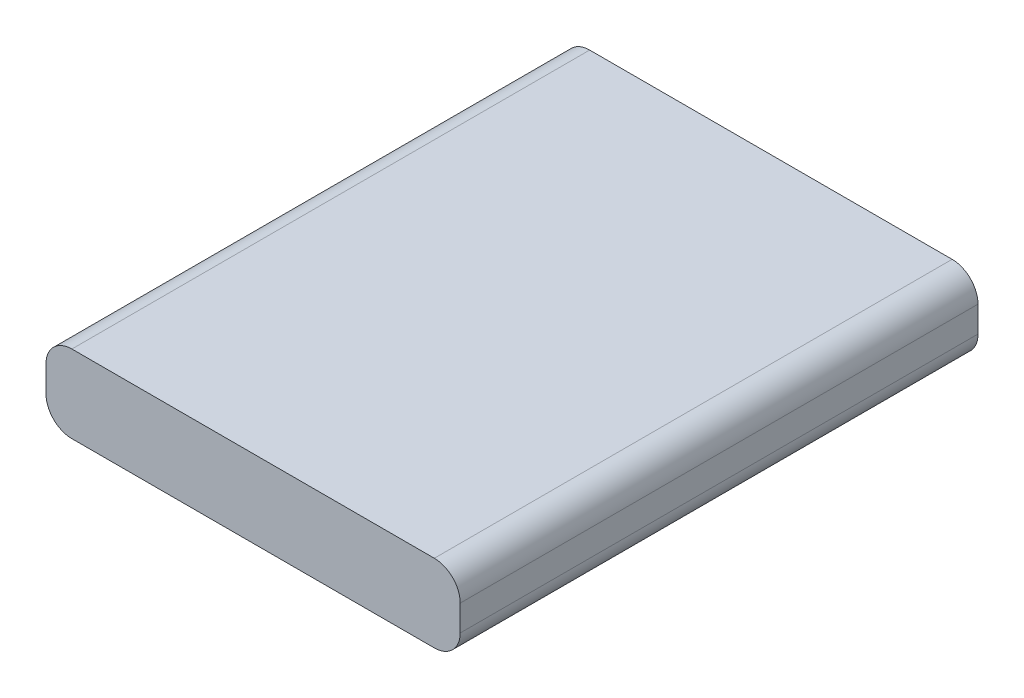
ISO-10303-21;
HEADER;
FILE_DESCRIPTION(('STEP AP214'),'2;1');
FILE_NAME('part.step','',(''),(''),'','','');
FILE_SCHEMA(('AUTOMOTIVE_DESIGN { 1 0 10303 214 1 1 1 1 }'));
ENDSEC;
DATA;
#1=APPLICATION_CONTEXT('core data for automotive mechanical design processes');
#2=APPLICATION_PROTOCOL_DEFINITION('international standard','automotive_design',2000,#1);
#3=PRODUCT_CONTEXT('',#1,'mechanical');
#4=PRODUCT('Part','Part','',(#3));
#5=PRODUCT_RELATED_PRODUCT_CATEGORY('part','',(#4));
#6=PRODUCT_DEFINITION_FORMATION('','',#4);
#7=PRODUCT_DEFINITION_CONTEXT('part definition',#1,'design');
#8=PRODUCT_DEFINITION('design','',#6,#7);
#9=PRODUCT_DEFINITION_SHAPE('','',#8);
#10=(LENGTH_UNIT() NAMED_UNIT(*) SI_UNIT(.MILLI.,.METRE.));
#11=(NAMED_UNIT(*) PLANE_ANGLE_UNIT() SI_UNIT($,.RADIAN.));
#12=(NAMED_UNIT(*) SI_UNIT($,.STERADIAN.) SOLID_ANGLE_UNIT());
#13=UNCERTAINTY_MEASURE_WITH_UNIT(LENGTH_MEASURE(1.E-05),#10,'distance_accuracy_value','');
#14=(GEOMETRIC_REPRESENTATION_CONTEXT(3) GLOBAL_UNCERTAINTY_ASSIGNED_CONTEXT((#13)) GLOBAL_UNIT_ASSIGNED_CONTEXT((#10,
#11,#12)) REPRESENTATION_CONTEXT('',''));
#15=CARTESIAN_POINT('',(0.,0.,0.));
#16=DIRECTION('',(0.,0.,1.));
#17=DIRECTION('',(1.,0.,0.));
#18=AXIS2_PLACEMENT_3D('',#15,#16,#17);
#19=CARTESIAN_POINT('',(24.,9.,30.));
#20=DIRECTION('',(-1.,0.,0.));
#21=DIRECTION('',(0.,0.,1.));
#22=AXIS2_PLACEMENT_3D('',#19,#20,#21);
#23=PLANE('',#22);
#24=DIRECTION('',(0.,-1.,0.));
#25=VECTOR('',#24,1.);
#26=CARTESIAN_POINT('',(24.,9.,30.));
#27=LINE('',#26,#25);
#28=CARTESIAN_POINT('',(24.,6.,30.));
#29=VERTEX_POINT('',#28);
#30=CARTESIAN_POINT('',(24.,3.,30.));
#31=VERTEX_POINT('',#30);
#32=EDGE_CURVE('E121',#29,#31,#27,.T.);
#33=ORIENTED_EDGE('',*,*,#32,.T.);
#34=DIRECTION('',(0.,0.,-1.));
#35=VECTOR('',#34,1.);
#36=CARTESIAN_POINT('',(24.,3.,-30.));
#37=LINE('',#36,#35);
#38=CARTESIAN_POINT('',(24.,3.,-30.));
#39=VERTEX_POINT('',#38);
#40=EDGE_CURVE('E11',#31,#39,#37,.T.);
#41=ORIENTED_EDGE('',*,*,#40,.T.);
#42=DIRECTION('',(0.,-1.,0.));
#43=VECTOR('',#42,1.);
#44=CARTESIAN_POINT('',(24.,9.,-30.));
#45=LINE('',#44,#43);
#46=CARTESIAN_POINT('',(24.,6.,-30.));
#47=VERTEX_POINT('',#46);
#48=EDGE_CURVE('E126',#47,#39,#45,.T.);
#49=ORIENTED_EDGE('',*,*,#48,.F.);
#50=DIRECTION('',(0.,0.,-1.));
#51=VECTOR('',#50,1.);
#52=CARTESIAN_POINT('',(24.,6.,30.));
#53=LINE('',#52,#51);
#54=EDGE_CURVE('E41',#47,#29,#53,.F.);
#55=ORIENTED_EDGE('',*,*,#54,.T.);
#56=EDGE_LOOP('',(#33,#41,#49,#55));
#57=FACE_BOUND('',#56,.T.);
#58=ADVANCED_FACE('F33',(#57),#23,.F.);
#59=CARTESIAN_POINT('',(-24.,9.,-30.));
#60=DIRECTION('',(0.,0.,1.));
#61=DIRECTION('',(1.,0.,0.));
#62=AXIS2_PLACEMENT_3D('',#59,#60,#61);
#63=PLANE('',#62);
#64=DIRECTION('',(-1.,0.,0.));
#65=VECTOR('',#64,1.);
#66=CARTESIAN_POINT('',(-24.,0.,-30.));
#67=LINE('',#66,#65);
#68=CARTESIAN_POINT('',(21.,0.,-30.));
#69=VERTEX_POINT('',#68);
#70=CARTESIAN_POINT('',(-21.,0.,-30.));
#71=VERTEX_POINT('',#70);
#72=EDGE_CURVE('E168',#69,#71,#67,.T.);
#73=ORIENTED_EDGE('',*,*,#72,.T.);
#74=CARTESIAN_POINT('',(-21.,3.,-30.));
#75=DIRECTION('',(0.,0.,1.));
#76=DIRECTION('',(1.,0.,0.));
#77=AXIS2_PLACEMENT_3D('',#74,#75,#76);
#78=CIRCLE('',#77,3.);
#79=CARTESIAN_POINT('',(-24.,3.,-30.));
#80=VERTEX_POINT('',#79);
#81=EDGE_CURVE('E143',#71,#80,#78,.F.);
#82=ORIENTED_EDGE('',*,*,#81,.T.);
#83=DIRECTION('',(0.,-1.,0.));
#84=VECTOR('',#83,1.);
#85=CARTESIAN_POINT('',(-24.,9.,-30.));
#86=LINE('',#85,#84);
#87=CARTESIAN_POINT('',(-24.,6.,-30.));
#88=VERTEX_POINT('',#87);
#89=EDGE_CURVE('E120',#88,#80,#86,.T.);
#90=ORIENTED_EDGE('',*,*,#89,.F.);
#91=CARTESIAN_POINT('',(-21.,6.,-30.));
#92=DIRECTION('',(0.,0.,1.));
#93=DIRECTION('',(1.,0.,0.));
#94=AXIS2_PLACEMENT_3D('',#91,#92,#93);
#95=CIRCLE('',#94,3.);
#96=CARTESIAN_POINT('',(-21.,9.,-30.));
#97=VERTEX_POINT('',#96);
#98=EDGE_CURVE('E125',#88,#97,#95,.F.);
#99=ORIENTED_EDGE('',*,*,#98,.T.);
#100=DIRECTION('',(-1.,0.,0.));
#101=VECTOR('',#100,1.);
#102=CARTESIAN_POINT('',(-24.,9.,-30.));
#103=LINE('',#102,#101);
#104=CARTESIAN_POINT('',(21.,9.,-30.));
#105=VERTEX_POINT('',#104);
#106=EDGE_CURVE('E162',#105,#97,#103,.T.);
#107=ORIENTED_EDGE('',*,*,#106,.F.);
#108=CARTESIAN_POINT('',(21.,6.,-30.));
#109=DIRECTION('',(0.,0.,1.));
#110=DIRECTION('',(1.,0.,0.));
#111=AXIS2_PLACEMENT_3D('',#108,#109,#110);
#112=CIRCLE('',#111,3.);
#113=EDGE_CURVE('E55',#105,#47,#112,.F.);
#114=ORIENTED_EDGE('',*,*,#113,.T.);
#115=ORIENTED_EDGE('',*,*,#48,.T.);
#116=CARTESIAN_POINT('',(21.,3.,-30.));
#117=DIRECTION('',(0.,0.,1.));
#118=DIRECTION('',(1.,0.,0.));
#119=AXIS2_PLACEMENT_3D('',#116,#117,#118);
#120=CIRCLE('',#119,3.);
#121=EDGE_CURVE('E48',#39,#69,#120,.F.);
#122=ORIENTED_EDGE('',*,*,#121,.T.);
#123=EDGE_LOOP('',(#73,#82,#90,#99,#107,#114,#115,#122));
#124=FACE_BOUND('',#123,.T.);
#125=ADVANCED_FACE('F164',(#124),#63,.F.);
#126=CARTESIAN_POINT('',(-24.,9.,30.));
#127=DIRECTION('',(1.,0.,0.));
#128=DIRECTION('',(0.,0.,-1.));
#129=AXIS2_PLACEMENT_3D('',#126,#127,#128);
#130=PLANE('',#129);
#131=ORIENTED_EDGE('',*,*,#89,.T.);
#132=DIRECTION('',(0.,0.,1.));
#133=VECTOR('',#132,1.);
#134=CARTESIAN_POINT('',(-24.,3.,30.));
#135=LINE('',#134,#133);
#136=CARTESIAN_POINT('',(-24.,3.,30.));
#137=VERTEX_POINT('',#136);
#138=EDGE_CURVE('E119',#80,#137,#135,.T.);
#139=ORIENTED_EDGE('',*,*,#138,.T.);
#140=DIRECTION('',(0.,-1.,0.));
#141=VECTOR('',#140,1.);
#142=CARTESIAN_POINT('',(-24.,9.,30.));
#143=LINE('',#142,#141);
#144=CARTESIAN_POINT('',(-24.,6.,30.));
#145=VERTEX_POINT('',#144);
#146=EDGE_CURVE('E102',#145,#137,#143,.T.);
#147=ORIENTED_EDGE('',*,*,#146,.F.);
#148=DIRECTION('',(0.,0.,1.));
#149=VECTOR('',#148,1.);
#150=CARTESIAN_POINT('',(-24.,6.,30.));
#151=LINE('',#150,#149);
#152=EDGE_CURVE('E116',#145,#88,#151,.F.);
#153=ORIENTED_EDGE('',*,*,#152,.T.);
#154=EDGE_LOOP('',(#131,#139,#147,#153));
#155=FACE_BOUND('',#154,.T.);
#156=ADVANCED_FACE('F115',(#155),#130,.F.);
#157=CARTESIAN_POINT('',(-24.,9.,30.));
#158=DIRECTION('',(0.,0.,-1.));
#159=DIRECTION('',(-1.,0.,0.));
#160=AXIS2_PLACEMENT_3D('',#157,#158,#159);
#161=PLANE('',#160);
#162=ORIENTED_EDGE('',*,*,#146,.T.);
#163=CARTESIAN_POINT('',(-21.,3.,30.));
#164=DIRECTION('',(0.,0.,-1.));
#165=DIRECTION('',(-1.,0.,0.));
#166=AXIS2_PLACEMENT_3D('',#163,#164,#165);
#167=CIRCLE('',#166,3.);
#168=CARTESIAN_POINT('',(-21.,0.,30.));
#169=VERTEX_POINT('',#168);
#170=EDGE_CURVE('E109',#137,#169,#167,.F.);
#171=ORIENTED_EDGE('',*,*,#170,.T.);
#172=DIRECTION('',(1.,0.,0.));
#173=VECTOR('',#172,1.);
#174=CARTESIAN_POINT('',(-24.,0.,30.));
#175=LINE('',#174,#173);
#176=CARTESIAN_POINT('',(21.,0.,30.));
#177=VERTEX_POINT('',#176);
#178=EDGE_CURVE('E165',#169,#177,#175,.T.);
#179=ORIENTED_EDGE('',*,*,#178,.T.);
#180=CARTESIAN_POINT('',(21.,3.,30.));
#181=DIRECTION('',(0.,0.,-1.));
#182=DIRECTION('',(-1.,0.,0.));
#183=AXIS2_PLACEMENT_3D('',#180,#181,#182);
#184=CIRCLE('',#183,3.);
#185=EDGE_CURVE('E110',#177,#31,#184,.F.);
#186=ORIENTED_EDGE('',*,*,#185,.T.);
#187=ORIENTED_EDGE('',*,*,#32,.F.);
#188=CARTESIAN_POINT('',(21.,6.,30.));
#189=DIRECTION('',(0.,0.,-1.));
#190=DIRECTION('',(-1.,0.,0.));
#191=AXIS2_PLACEMENT_3D('',#188,#189,#190);
#192=CIRCLE('',#191,3.);
#193=CARTESIAN_POINT('',(21.,9.,30.));
#194=VERTEX_POINT('',#193);
#195=EDGE_CURVE('E128',#29,#194,#192,.F.);
#196=ORIENTED_EDGE('',*,*,#195,.T.);
#197=DIRECTION('',(1.,0.,0.));
#198=VECTOR('',#197,1.);
#199=CARTESIAN_POINT('',(-24.,9.,30.));
#200=LINE('',#199,#198);
#201=CARTESIAN_POINT('',(-21.,9.,30.));
#202=VERTEX_POINT('',#201);
#203=EDGE_CURVE('E104',#202,#194,#200,.T.);
#204=ORIENTED_EDGE('',*,*,#203,.F.);
#205=CARTESIAN_POINT('',(-21.,6.,30.));
#206=DIRECTION('',(0.,0.,-1.));
#207=DIRECTION('',(-1.,0.,0.));
#208=AXIS2_PLACEMENT_3D('',#205,#206,#207);
#209=CIRCLE('',#208,3.);
#210=EDGE_CURVE('E99',#202,#145,#209,.F.);
#211=ORIENTED_EDGE('',*,*,#210,.T.);
#212=EDGE_LOOP('',(#162,#171,#179,#186,#187,#196,#204,#211));
#213=FACE_BOUND('',#212,.T.);
#214=ADVANCED_FACE('F101',(#213),#161,.F.);
#215=CARTESIAN_POINT('',(0.,9.,0.));
#216=DIRECTION('',(0.,-1.,0.));
#217=DIRECTION('',(0.,0.,-1.));
#218=AXIS2_PLACEMENT_3D('',#215,#216,#217);
#219=PLANE('',#218);
#220=ORIENTED_EDGE('',*,*,#106,.T.);
#221=DIRECTION('',(0.,0.,1.));
#222=VECTOR('',#221,1.);
#223=CARTESIAN_POINT('',(-21.,9.,0.));
#224=LINE('',#223,#222);
#225=EDGE_CURVE('E148',#97,#202,#224,.T.);
#226=ORIENTED_EDGE('',*,*,#225,.T.);
#227=ORIENTED_EDGE('',*,*,#203,.T.);
#228=DIRECTION('',(0.,0.,-1.));
#229=VECTOR('',#228,1.);
#230=CARTESIAN_POINT('',(21.,9.,0.));
#231=LINE('',#230,#229);
#232=EDGE_CURVE('E145',#194,#105,#231,.T.);
#233=ORIENTED_EDGE('',*,*,#232,.T.);
#234=EDGE_LOOP('',(#220,#226,#227,#233));
#235=FACE_BOUND('',#234,.T.);
#236=ADVANCED_FACE('F161',(#235),#219,.F.);
#237=CARTESIAN_POINT('',(0.,0.,0.));
#238=DIRECTION('',(0.,-1.,0.));
#239=DIRECTION('',(0.,0.,-1.));
#240=AXIS2_PLACEMENT_3D('',#237,#238,#239);
#241=PLANE('',#240);
#242=ORIENTED_EDGE('',*,*,#178,.F.);
#243=DIRECTION('',(0.,0.,1.));
#244=VECTOR('',#243,1.);
#245=CARTESIAN_POINT('',(-21.,0.,-30.));
#246=LINE('',#245,#244);
#247=EDGE_CURVE('E138',#169,#71,#246,.F.);
#248=ORIENTED_EDGE('',*,*,#247,.T.);
#249=ORIENTED_EDGE('',*,*,#72,.F.);
#250=DIRECTION('',(0.,0.,-1.));
#251=VECTOR('',#250,1.);
#252=CARTESIAN_POINT('',(21.,0.,30.));
#253=LINE('',#252,#251);
#254=EDGE_CURVE('E136',#69,#177,#253,.F.);
#255=ORIENTED_EDGE('',*,*,#254,.T.);
#256=EDGE_LOOP('',(#242,#248,#249,#255));
#257=FACE_BOUND('',#256,.T.);
#258=ADVANCED_FACE('F177',(#257),#241,.T.);
#259=CARTESIAN_POINT('',(-21.,3.,30.));
#260=DIRECTION('',(0.,0.,-1.));
#261=DIRECTION('',(-1.,0.,0.));
#262=AXIS2_PLACEMENT_3D('',#259,#260,#261);
#263=CYLINDRICAL_SURFACE('',#262,3.);
#264=ORIENTED_EDGE('',*,*,#81,.F.);
#265=ORIENTED_EDGE('',*,*,#247,.F.);
#266=ORIENTED_EDGE('',*,*,#170,.F.);
#267=ORIENTED_EDGE('',*,*,#138,.F.);
#268=EDGE_LOOP('',(#264,#265,#266,#267));
#269=FACE_BOUND('',#268,.T.);
#270=ADVANCED_FACE('F173',(#269),#263,.T.);
#271=CARTESIAN_POINT('',(-21.,6.,0.));
#272=DIRECTION('',(0.,0.,1.));
#273=DIRECTION('',(1.,0.,0.));
#274=AXIS2_PLACEMENT_3D('',#271,#272,#273);
#275=CYLINDRICAL_SURFACE('',#274,3.);
#276=ORIENTED_EDGE('',*,*,#98,.F.);
#277=ORIENTED_EDGE('',*,*,#152,.F.);
#278=ORIENTED_EDGE('',*,*,#210,.F.);
#279=ORIENTED_EDGE('',*,*,#225,.F.);
#280=EDGE_LOOP('',(#276,#277,#278,#279));
#281=FACE_BOUND('',#280,.T.);
#282=ADVANCED_FACE('F124',(#281),#275,.T.);
#283=CARTESIAN_POINT('',(21.,3.,30.));
#284=DIRECTION('',(0.,0.,1.));
#285=DIRECTION('',(1.,0.,0.));
#286=AXIS2_PLACEMENT_3D('',#283,#284,#285);
#287=CYLINDRICAL_SURFACE('',#286,3.);
#288=ORIENTED_EDGE('',*,*,#185,.F.);
#289=ORIENTED_EDGE('',*,*,#254,.F.);
#290=ORIENTED_EDGE('',*,*,#121,.F.);
#291=ORIENTED_EDGE('',*,*,#40,.F.);
#292=EDGE_LOOP('',(#288,#289,#290,#291));
#293=FACE_BOUND('',#292,.T.);
#294=ADVANCED_FACE('F179',(#293),#287,.T.);
#295=CARTESIAN_POINT('',(21.,6.,0.));
#296=DIRECTION('',(0.,0.,-1.));
#297=DIRECTION('',(-1.,0.,0.));
#298=AXIS2_PLACEMENT_3D('',#295,#296,#297);
#299=CYLINDRICAL_SURFACE('',#298,3.);
#300=ORIENTED_EDGE('',*,*,#195,.F.);
#301=ORIENTED_EDGE('',*,*,#54,.F.);
#302=ORIENTED_EDGE('',*,*,#113,.F.);
#303=ORIENTED_EDGE('',*,*,#232,.F.);
#304=EDGE_LOOP('',(#300,#301,#302,#303));
#305=FACE_BOUND('',#304,.T.);
#306=ADVANCED_FACE('F35',(#305),#299,.T.);
#307=CLOSED_SHELL('',(#58,#125,#156,#214,#236,#258,#270,#282,#294,#306));
#308=MANIFOLD_SOLID_BREP('B2',#307);
#309=ADVANCED_BREP_SHAPE_REPRESENTATION('',(#18,#308),#14);
#310=SHAPE_DEFINITION_REPRESENTATION(#9,#309);
ENDSEC;
END-ISO-10303-21;
